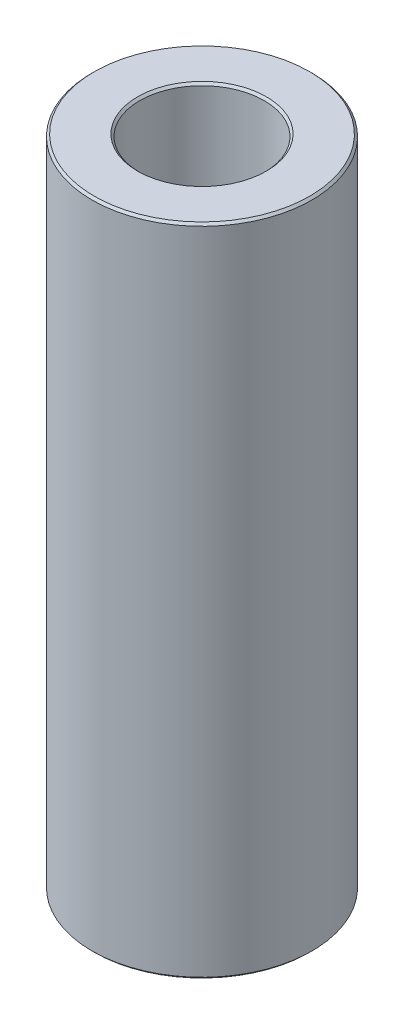
ISO-10303-21;
HEADER;
FILE_DESCRIPTION(('STEP AP214'),'2;1');
FILE_NAME('part.step','',(''),(''),'','','');
FILE_SCHEMA(('AUTOMOTIVE_DESIGN { 1 0 10303 214 1 1 1 1 }'));
ENDSEC;
DATA;
#1=APPLICATION_CONTEXT('core data for automotive mechanical design processes');
#2=APPLICATION_PROTOCOL_DEFINITION('international standard','automotive_design',2000,#1);
#3=PRODUCT_CONTEXT('',#1,'mechanical');
#4=PRODUCT('Part','Part','',(#3));
#5=PRODUCT_RELATED_PRODUCT_CATEGORY('part','',(#4));
#6=PRODUCT_DEFINITION_FORMATION('','',#4);
#7=PRODUCT_DEFINITION_CONTEXT('part definition',#1,'design');
#8=PRODUCT_DEFINITION('design','',#6,#7);
#9=PRODUCT_DEFINITION_SHAPE('','',#8);
#10=(LENGTH_UNIT() NAMED_UNIT(*) SI_UNIT(.MILLI.,.METRE.));
#11=(NAMED_UNIT(*) PLANE_ANGLE_UNIT() SI_UNIT($,.RADIAN.));
#12=(NAMED_UNIT(*) SI_UNIT($,.STERADIAN.) SOLID_ANGLE_UNIT());
#13=UNCERTAINTY_MEASURE_WITH_UNIT(LENGTH_MEASURE(1.E-05),#10,'distance_accuracy_value','');
#14=(GEOMETRIC_REPRESENTATION_CONTEXT(3) GLOBAL_UNCERTAINTY_ASSIGNED_CONTEXT((#13)) GLOBAL_UNIT_ASSIGNED_CONTEXT((#10,
#11,#12)) REPRESENTATION_CONTEXT('',''));
#15=CARTESIAN_POINT('',(0.,0.,0.));
#16=DIRECTION('',(0.,0.,1.));
#17=DIRECTION('',(1.,0.,0.));
#18=AXIS2_PLACEMENT_3D('',#15,#16,#17);
#19=CARTESIAN_POINT('',(0.,252.979951956953,0.));
#20=DIRECTION('',(0.,-1.,0.));
#21=DIRECTION('',(0.,0.,-1.));
#22=AXIS2_PLACEMENT_3D('',#19,#20,#21);
#23=CYLINDRICAL_SURFACE('',#22,42.5);
#24=CARTESIAN_POINT('',(0.,0.854161998392,0.));
#25=DIRECTION('',(0.,1.,0.));
#26=DIRECTION('',(0.,0.,1.));
#27=AXIS2_PLACEMENT_3D('',#24,#25,#26);
#28=CIRCLE('',#27,42.5);
#29=CARTESIAN_POINT('',(0.,0.854161998392,42.5));
#30=VERTEX_POINT('',#29);
#31=EDGE_CURVE('E10',#30,#30,#28,.T.);
#32=ORIENTED_EDGE('',*,*,#31,.T.);
#33=EDGE_LOOP('',(#32));
#34=FACE_BOUND('',#33,.T.);
#35=CARTESIAN_POINT('',(0.,252.125789958561,0.));
#36=DIRECTION('',(0.,1.,0.));
#37=DIRECTION('',(0.,0.,1.));
#38=AXIS2_PLACEMENT_3D('',#35,#36,#37);
#39=CIRCLE('',#38,42.5);
#40=CARTESIAN_POINT('',(0.,252.125789958561,-42.5));
#41=VERTEX_POINT('',#40);
#42=EDGE_CURVE('E50',#41,#41,#39,.F.);
#43=ORIENTED_EDGE('',*,*,#42,.T.);
#44=EDGE_LOOP('',(#43));
#45=FACE_BOUND('',#44,.T.);
#46=ADVANCED_FACE('F39',(#34,#45),#23,.T.);
#47=CARTESIAN_POINT('',(0.,252.979951956953,0.));
#48=DIRECTION('',(0.,1.,0.));
#49=DIRECTION('',(0.,0.,1.));
#50=AXIS2_PLACEMENT_3D('',#47,#48,#49);
#51=PLANE('',#50);
#52=CARTESIAN_POINT('',(0.,252.979951956953,0.));
#53=DIRECTION('',(0.,1.,0.));
#54=DIRECTION('',(0.,0.,1.));
#55=AXIS2_PLACEMENT_3D('',#52,#53,#54);
#56=CIRCLE('',#55,24.8964113158572);
#57=CARTESIAN_POINT('',(0.,252.979951956953,24.8964113158572));
#58=VERTEX_POINT('',#57);
#59=EDGE_CURVE('E58',#58,#58,#56,.F.);
#60=ORIENTED_EDGE('',*,*,#59,.T.);
#61=EDGE_LOOP('',(#60));
#62=FACE_BOUND('',#61,.T.);
#63=CARTESIAN_POINT('',(0.,252.979951956953,0.));
#64=DIRECTION('',(0.,1.,0.));
#65=DIRECTION('',(0.,0.,1.));
#66=AXIS2_PLACEMENT_3D('',#63,#64,#65);
#67=CIRCLE('',#66,41.6458380016081);
#68=CARTESIAN_POINT('',(0.,252.979951956953,-41.6458380016081));
#69=VERTEX_POINT('',#68);
#70=EDGE_CURVE('E61',#69,#69,#67,.T.);
#71=ORIENTED_EDGE('',*,*,#70,.T.);
#72=EDGE_LOOP('',(#71));
#73=FACE_BOUND('',#72,.T.);
#74=ADVANCED_FACE('F88',(#62,#73),#51,.T.);
#75=CARTESIAN_POINT('',(0.,0.,0.));
#76=DIRECTION('',(0.,1.,0.));
#77=DIRECTION('',(0.,0.,1.));
#78=AXIS2_PLACEMENT_3D('',#75,#76,#77);
#79=PLANE('',#78);
#80=CARTESIAN_POINT('',(0.,0.,0.));
#81=DIRECTION('',(0.,1.,0.));
#82=DIRECTION('',(0.,0.,1.));
#83=AXIS2_PLACEMENT_3D('',#80,#81,#82);
#84=CIRCLE('',#83,24.8964113158572);
#85=CARTESIAN_POINT('',(0.,0.,-24.8964113158572));
#86=VERTEX_POINT('',#85);
#87=EDGE_CURVE('E51',#86,#86,#84,.T.);
#88=ORIENTED_EDGE('',*,*,#87,.T.);
#89=EDGE_LOOP('',(#88));
#90=FACE_BOUND('',#89,.T.);
#91=CARTESIAN_POINT('',(0.,0.,0.));
#92=DIRECTION('',(0.,1.,0.));
#93=DIRECTION('',(0.,0.,1.));
#94=AXIS2_PLACEMENT_3D('',#91,#92,#93);
#95=CIRCLE('',#94,41.645838001608);
#96=CARTESIAN_POINT('',(0.,0.,41.645838001608));
#97=VERTEX_POINT('',#96);
#98=EDGE_CURVE('E54',#97,#97,#95,.F.);
#99=ORIENTED_EDGE('',*,*,#98,.T.);
#100=EDGE_LOOP('',(#99));
#101=FACE_BOUND('',#100,.T.);
#102=ADVANCED_FACE('F83',(#90,#101),#79,.F.);
#103=CARTESIAN_POINT('',(0.,252.979951956953,0.));
#104=DIRECTION('',(0.,-1.,0.));
#105=DIRECTION('',(0.,0.,-1.));
#106=AXIS2_PLACEMENT_3D('',#103,#104,#105);
#107=CYLINDRICAL_SURFACE('',#106,24.0422493174653);
#108=CARTESIAN_POINT('',(0.,252.125789958561,0.));
#109=DIRECTION('',(0.,1.,0.));
#110=DIRECTION('',(0.,0.,1.));
#111=AXIS2_PLACEMENT_3D('',#108,#109,#110);
#112=CIRCLE('',#111,24.0422493174653);
#113=CARTESIAN_POINT('',(0.,252.125789958561,-24.0422493174653));
#114=VERTEX_POINT('',#113);
#115=EDGE_CURVE('E67',#114,#114,#112,.T.);
#116=CARTESIAN_POINT('',(0.,0.854161998391945,0.));
#117=DIRECTION('',(0.,1.,0.));
#118=DIRECTION('',(0.,0.,1.));
#119=AXIS2_PLACEMENT_3D('',#116,#117,#118);
#120=CIRCLE('',#119,24.0422493174653);
#121=CARTESIAN_POINT('',(0.,0.854161998391945,-24.0422493174653));
#122=VERTEX_POINT('',#121);
#123=EDGE_CURVE('E69',#122,#122,#120,.F.);
#124=CARTESIAN_POINT('',(0.,252.125789958561,-24.0422493174653));
#125=CARTESIAN_POINT('',(0.,249.508377167309,-24.0422493174653));
#126=CARTESIAN_POINT('',(0.,246.890964376057,-24.0422493174653));
#127=CARTESIAN_POINT('',(0.,241.656138793554,-24.0422493174653));
#128=CARTESIAN_POINT('',(0.,239.038726002302,-24.0422493174653));
#129=CARTESIAN_POINT('',(0.,233.803900419799,-24.0422493174653));
#130=CARTESIAN_POINT('',(0.,231.186487628547,-24.0422493174653));
#131=CARTESIAN_POINT('',(0.,225.951662046043,-24.0422493174653));
#132=CARTESIAN_POINT('',(0.,223.334249254792,-24.0422493174653));
#133=CARTESIAN_POINT('',(0.,218.099423672288,-24.0422493174653));
#134=CARTESIAN_POINT('',(0.,215.482010881036,-24.0422493174653));
#135=CARTESIAN_POINT('',(0.,210.247185298533,-24.0422493174653));
#136=CARTESIAN_POINT('',(0.,207.629772507281,-24.0422493174653));
#137=CARTESIAN_POINT('',(0.,202.394946924778,-24.0422493174653));
#138=CARTESIAN_POINT('',(0.,199.777534133526,-24.0422493174653));
#139=CARTESIAN_POINT('',(0.,194.542708551022,-24.0422493174653));
#140=CARTESIAN_POINT('',(0.,191.925295759771,-24.0422493174653));
#141=CARTESIAN_POINT('',(0.,186.690470177267,-24.0422493174653));
#142=CARTESIAN_POINT('',(0.,184.073057386015,-24.0422493174653));
#143=CARTESIAN_POINT('',(0.,178.838231803512,-24.0422493174653));
#144=CARTESIAN_POINT('',(0.,176.22081901226,-24.0422493174653));
#145=CARTESIAN_POINT('',(0.,170.985993429756,-24.0422493174653));
#146=CARTESIAN_POINT('',(0.,168.368580638505,-24.0422493174653));
#147=CARTESIAN_POINT('',(0.,163.133755056001,-24.0422493174653));
#148=CARTESIAN_POINT('',(0.,160.516342264749,-24.0422493174653));
#149=CARTESIAN_POINT('',(0.,155.281516682246,-24.0422493174653));
#150=CARTESIAN_POINT('',(0.,152.664103890994,-24.0422493174653));
#151=CARTESIAN_POINT('',(0.,147.429278308491,-24.0422493174653));
#152=CARTESIAN_POINT('',(0.,144.811865517239,-24.0422493174653));
#153=CARTESIAN_POINT('',(0.,139.577039934735,-24.0422493174653));
#154=CARTESIAN_POINT('',(0.,136.959627143484,-24.0422493174653));
#155=CARTESIAN_POINT('',(0.,131.72480156098,-24.0422493174653));
#156=CARTESIAN_POINT('',(0.,129.107388769728,-24.0422493174653));
#157=CARTESIAN_POINT('',(0.,123.872563187225,-24.0422493174653));
#158=CARTESIAN_POINT('',(0.,121.255150395973,-24.0422493174653));
#159=CARTESIAN_POINT('',(0.,116.020324813469,-24.0422493174653));
#160=CARTESIAN_POINT('',(0.,113.402912022218,-24.0422493174653));
#161=CARTESIAN_POINT('',(0.,108.168086439714,-24.0422493174653));
#162=CARTESIAN_POINT('',(0.,105.550673648462,-24.0422493174653));
#163=CARTESIAN_POINT('',(0.,100.315848065959,-24.0422493174653));
#164=CARTESIAN_POINT('',(0.,97.6984352747071,-24.0422493174653));
#165=CARTESIAN_POINT('',(0.,92.4636096922036,-24.0422493174653));
#166=CARTESIAN_POINT('',(0.,89.8461969009518,-24.0422493174653));
#167=CARTESIAN_POINT('',(0.,84.6113713184483,-24.0422493174653));
#168=CARTESIAN_POINT('',(0.,81.9939585271965,-24.0422493174653));
#169=CARTESIAN_POINT('',(0.,76.759132944693,-24.0422493174653));
#170=CARTESIAN_POINT('',(0.,74.1417201534412,-24.0422493174653));
#171=CARTESIAN_POINT('',(0.,68.9068945709377,-24.0422493174653));
#172=CARTESIAN_POINT('',(0.,66.289481779686,-24.0422493174653));
#173=CARTESIAN_POINT('',(0.,61.0546561971824,-24.0422493174653));
#174=CARTESIAN_POINT('',(0.,58.4372434059307,-24.0422493174653));
#175=CARTESIAN_POINT('',(0.,53.2024178234271,-24.0422493174653));
#176=CARTESIAN_POINT('',(0.,50.5850050321754,-24.0422493174653));
#177=CARTESIAN_POINT('',(0.,45.3501794496719,-24.0422493174653));
#178=CARTESIAN_POINT('',(0.,42.7327666584201,-24.0422493174653));
#179=CARTESIAN_POINT('',(0.,37.4979410759166,-24.0422493174653));
#180=CARTESIAN_POINT('',(0.,34.8805282846648,-24.0422493174653));
#181=CARTESIAN_POINT('',(0.,29.6457027021613,-24.0422493174653));
#182=CARTESIAN_POINT('',(0.,27.0282899109095,-24.0422493174653));
#183=CARTESIAN_POINT('',(0.,21.793464328406,-24.0422493174653));
#184=CARTESIAN_POINT('',(0.,19.1760515371543,-24.0422493174653));
#185=CARTESIAN_POINT('',(0.,13.9412259546507,-24.0422493174653));
#186=CARTESIAN_POINT('',(0.,11.323813163399,-24.0422493174653));
#187=CARTESIAN_POINT('',(0.,6.08898758089545,-24.0422493174653));
#188=CARTESIAN_POINT('',(0.,3.4715747896437,-24.0422493174653));
#189=CARTESIAN_POINT('',(0.,0.854161998391945,-24.0422493174653));
#190=B_SPLINE_CURVE_WITH_KNOTS('',3,(#124,#125,#126,#127,#128,#129,#130,#131,#132,#133,#134,
#135,#136,#137,#138,#139,#140,#141,#142,#143,#144,#145,#146,#147,#148,#149,#150,#151,#152,#153,
#154,#155,#156,#157,#158,#159,#160,#161,#162,#163,#164,#165,#166,#167,#168,#169,#170,#171,#172,
#173,#174,#175,#176,#177,#178,#179,#180,#181,#182,#183,#184,#185,#186,#187,#188,#189),
.UNSPECIFIED.,.F.,.F.,(4,2,2,2,2,2,2,2,2,2,2,2,2,2,2,2,2,2,2,2,2,2,2,2,2,2,2,2,2,2,2,2,4),(0.,
7.85223837375532,15.7044767475106,23.5567151212659,31.4089534950212,39.2611918687765,
47.1134302425317,54.965668616287,62.8179069900423,70.6701453637976,78.5223837375529,
86.3746221113081,94.2268604850635,102.079098858819,109.931337232574,117.783575606329,
125.635813980085,133.48805235384,141.340290727595,149.19252910135,157.044767475106,
164.897005848861,172.749244222616,180.601482596372,188.453720970127,196.305959343882,
204.158197717637,212.010436091393,219.862674465148,227.714912838903,235.567151212659,
243.419389586414,251.271627960169),.UNSPECIFIED.);
#191=EDGE_CURVE('BSEAM71',#114,#122,#190,.T.);
#192=ORIENTED_EDGE('',*,*,#115,.T.);
#193=ORIENTED_EDGE('',*,*,#123,.T.);
#194=ORIENTED_EDGE('',*,*,#191,.T.);
#195=ORIENTED_EDGE('',*,*,#191,.F.);
#196=EDGE_LOOP('',(#192,#194,#193,#195));
#197=FACE_BOUND('',#196,.T.);
#198=ADVANCED_FACE('F71',(#197),#107,.F.);
#199=CARTESIAN_POINT('',(0.,252.125789958561,0.));
#200=DIRECTION('',(0.,1.,0.));
#201=DIRECTION('',(0.,0.,1.));
#202=AXIS2_PLACEMENT_3D('',#199,#200,#201);
#203=CONICAL_SURFACE('',#202,24.0422493174653,0.785398163397438);
#204=ORIENTED_EDGE('',*,*,#59,.F.);
#205=EDGE_LOOP('',(#204));
#206=FACE_BOUND('',#205,.T.);
#207=ORIENTED_EDGE('',*,*,#115,.F.);
#208=EDGE_LOOP('',(#207));
#209=FACE_BOUND('',#208,.T.);
#210=ADVANCED_FACE('F77',(#206,#209),#203,.F.);
#211=CARTESIAN_POINT('',(0.,0.,0.));
#212=DIRECTION('',(0.,-1.,0.));
#213=DIRECTION('',(0.,0.,-1.));
#214=AXIS2_PLACEMENT_3D('',#211,#212,#213);
#215=CONICAL_SURFACE('',#214,24.8964113158572,0.785398163397438);
#216=CARTESIAN_POINT('',(0.,0.854161998391945,-24.0422493174653));
#217=CARTESIAN_POINT('',(0.,0.845264477575362,-24.0511468382819));
#218=CARTESIAN_POINT('',(0.,0.836366956758779,-24.0600443590984));
#219=CARTESIAN_POINT('',(0.,0.818571915125613,-24.0778394007316));
#220=CARTESIAN_POINT('',(0.,0.809674394309031,-24.0867369215482));
#221=CARTESIAN_POINT('',(0.,0.791879352675865,-24.1045319631814));
#222=CARTESIAN_POINT('',(0.,0.782981831859283,-24.1134294839979));
#223=CARTESIAN_POINT('',(0.,0.765186790226117,-24.1312245256311));
#224=CARTESIAN_POINT('',(0.,0.756289269409534,-24.1401220464477));
#225=CARTESIAN_POINT('',(0.,0.738494227776368,-24.1579170880809));
#226=CARTESIAN_POINT('',(0.,0.729596706959786,-24.1668146088974));
#227=CARTESIAN_POINT('',(0.,0.71180166532662,-24.1846096505306));
#228=CARTESIAN_POINT('',(0.,0.702904144510038,-24.1935071713472));
#229=CARTESIAN_POINT('',(0.,0.685109102876872,-24.2113022129803));
#230=CARTESIAN_POINT('',(0.,0.676211582060289,-24.2201997337969));
#231=CARTESIAN_POINT('',(0.,0.658416540427124,-24.2379947754301));
#232=CARTESIAN_POINT('',(0.,0.649519019610541,-24.2468922962467));
#233=CARTESIAN_POINT('',(0.,0.631723977977376,-24.2646873378798));
#234=CARTESIAN_POINT('',(0.,0.622826457160793,-24.2735848586964));
#235=CARTESIAN_POINT('',(0.,0.605031415527628,-24.2913799003296));
#236=CARTESIAN_POINT('',(0.,0.596133894711044,-24.3002774211462));
#237=CARTESIAN_POINT('',(0.,0.578338853077879,-24.3180724627793));
#238=CARTESIAN_POINT('',(0.,0.569441332261296,-24.3269699835959));
#239=CARTESIAN_POINT('',(0.,0.551646290628131,-24.3447650252291));
#240=CARTESIAN_POINT('',(0.,0.542748769811548,-24.3536625460457));
#241=CARTESIAN_POINT('',(0.,0.524953728178382,-24.3714575876788));
#242=CARTESIAN_POINT('',(0.,0.5160562073618,-24.3803551084954));
#243=CARTESIAN_POINT('',(0.,0.498261165728634,-24.3981501501286));
#244=CARTESIAN_POINT('',(0.,0.489363644912051,-24.4070476709452));
#245=CARTESIAN_POINT('',(0.,0.471568603278886,-24.4248427125783));
#246=CARTESIAN_POINT('',(0.,0.462671082462304,-24.4337402333949));
#247=CARTESIAN_POINT('',(0.,0.444876040829138,-24.4515352750281));
#248=CARTESIAN_POINT('',(0.,0.435978520012555,-24.4604327958447));
#249=CARTESIAN_POINT('',(0.,0.418183478379389,-24.4782278374778));
#250=CARTESIAN_POINT('',(0.,0.409285957562807,-24.4871253582944));
#251=CARTESIAN_POINT('',(0.,0.391490915929641,-24.5049203999276));
#252=CARTESIAN_POINT('',(0.,0.382593395113059,-24.5138179207442));
#253=CARTESIAN_POINT('',(0.,0.364798353479893,-24.5316129623773));
#254=CARTESIAN_POINT('',(0.,0.35590083266331,-24.5405104831939));
#255=CARTESIAN_POINT('',(0.,0.338105791030145,-24.5583055248271));
#256=CARTESIAN_POINT('',(0.,0.329208270213562,-24.5672030456437));
#257=CARTESIAN_POINT('',(0.,0.311413228580396,-24.5849980872768));
#258=CARTESIAN_POINT('',(0.,0.302515707763814,-24.5938956080934));
#259=CARTESIAN_POINT('',(0.,0.284720666130648,-24.6116906497266));
#260=CARTESIAN_POINT('',(0.,0.275823145314066,-24.6205881705431));
#261=CARTESIAN_POINT('',(0.,0.2580281036809,-24.6383832121763));
#262=CARTESIAN_POINT('',(0.,0.249130582864317,-24.6472807329929));
#263=CARTESIAN_POINT('',(0.,0.231335541231151,-24.6650757746261));
#264=CARTESIAN_POINT('',(0.,0.222438020414569,-24.6739732954426));
#265=CARTESIAN_POINT('',(0.,0.204642978781403,-24.6917683370758));
#266=CARTESIAN_POINT('',(0.,0.195745457964821,-24.7006658578924));
#267=CARTESIAN_POINT('',(0.,0.177950416331655,-24.7184608995256));
#268=CARTESIAN_POINT('',(0.,0.169052895515072,-24.7273584203421));
#269=CARTESIAN_POINT('',(0.,0.151257853881907,-24.7451534619753));
#270=CARTESIAN_POINT('',(0.,0.142360333065324,-24.7540509827919));
#271=CARTESIAN_POINT('',(0.,0.124565291432159,-24.771846024425));
#272=CARTESIAN_POINT('',(0.,0.115667770615576,-24.7807435452416));
#273=CARTESIAN_POINT('',(0.,0.0978727289824105,-24.7985385868748));
#274=CARTESIAN_POINT('',(0.,0.0889752081658273,-24.8074361076914));
#275=CARTESIAN_POINT('',(0.,0.0711801665326617,-24.8252311493245));
#276=CARTESIAN_POINT('',(0.,0.0622826457160792,-24.8341286701411));
#277=CARTESIAN_POINT('',(0.,0.0444876040829139,-24.8519237117743));
#278=CARTESIAN_POINT('',(0.,0.0355900832663311,-24.8608212325909));
#279=CARTESIAN_POINT('',(0.,0.0177950416331655,-24.878616274224));
#280=CARTESIAN_POINT('',(0.,0.00889752081658265,-24.8875137950406));
#281=CARTESIAN_POINT('',(0.,0.,-24.8964113158572));
#282=B_SPLINE_CURVE_WITH_KNOTS('',3,(#216,#217,#218,#219,#220,#221,#222,#223,#224,#225,#226,
#227,#228,#229,#230,#231,#232,#233,#234,#235,#236,#237,#238,#239,#240,#241,#242,#243,#244,#245,
#246,#247,#248,#249,#250,#251,#252,#253,#254,#255,#256,#257,#258,#259,#260,#261,#262,#263,#264,
#265,#266,#267,#268,#269,#270,#271,#272,#273,#274,#275,#276,#277,#278,#279,#280,#281),
.UNSPECIFIED.,.F.,.F.,(4,2,2,2,2,2,2,2,2,2,2,2,2,2,2,2,2,2,2,2,2,2,2,2,2,2,2,2,2,2,2,2,4),(0.,
0.0377489838309248,0.0754979676618496,0.113246951492774,0.150995935323697,0.188744919154622,
0.226493902985546,0.264242886816471,0.301991870647396,0.339740854478321,0.377489838309243,
0.415238822140168,0.452987805971093,0.490736789802018,0.528485773632942,0.566234757463867,
0.603983741294789,0.641732725125714,0.679481708956639,0.717230692787564,0.754979676618489,
0.792728660449414,0.830477644280338,0.868226628111261,0.905975611942186,0.94372459577311,
0.981473579604035,1.01922256343496,1.05697154726588,1.09472053109681,1.13246951492773,
1.17021849875866,1.20796748258958),.UNSPECIFIED.);
#283=EDGE_CURVE('BSEAM73',#122,#86,#282,.T.);
#284=ORIENTED_EDGE('',*,*,#123,.F.);
#285=ORIENTED_EDGE('',*,*,#87,.F.);
#286=ORIENTED_EDGE('',*,*,#283,.T.);
#287=ORIENTED_EDGE('',*,*,#283,.F.);
#288=EDGE_LOOP('',(#284,#286,#285,#287));
#289=FACE_BOUND('',#288,.T.);
#290=ADVANCED_FACE('F73',(#289),#215,.F.);
#291=CARTESIAN_POINT('',(0.,0.854161998392,0.));
#292=DIRECTION('',(0.,1.,0.));
#293=DIRECTION('',(0.,0.,1.));
#294=AXIS2_PLACEMENT_3D('',#291,#292,#293);
#295=CONICAL_SURFACE('',#294,42.5,0.785398163397432);
#296=ORIENTED_EDGE('',*,*,#98,.F.);
#297=EDGE_LOOP('',(#296));
#298=FACE_BOUND('',#297,.T.);
#299=ORIENTED_EDGE('',*,*,#31,.F.);
#300=EDGE_LOOP('',(#299));
#301=FACE_BOUND('',#300,.T.);
#302=ADVANCED_FACE('F76',(#298,#301),#295,.T.);
#303=CARTESIAN_POINT('',(0.,252.979951956953,0.));
#304=DIRECTION('',(0.,-1.,0.));
#305=DIRECTION('',(0.,0.,-1.));
#306=AXIS2_PLACEMENT_3D('',#303,#304,#305);
#307=CONICAL_SURFACE('',#306,41.6458380016081,0.785398163397432);
#308=CARTESIAN_POINT('',(0.,252.125789958561,-42.5));
#309=CARTESIAN_POINT('',(0.,252.134687479378,-42.4911024791835));
#310=CARTESIAN_POINT('',(0.,252.143585000194,-42.4822049583669));
#311=CARTESIAN_POINT('',(0.,252.161380041827,-42.4644099167337));
#312=CARTESIAN_POINT('',(0.,252.170277562644,-42.4555123959171));
#313=CARTESIAN_POINT('',(0.,252.188072604277,-42.437717354284));
#314=CARTESIAN_POINT('',(0.,252.196970125094,-42.4288198334674));
#315=CARTESIAN_POINT('',(0.,252.214765166727,-42.4110247918342));
#316=CARTESIAN_POINT('',(0.,252.223662687543,-42.4021272710176));
#317=CARTESIAN_POINT('',(0.,252.241457729177,-42.3843322293845));
#318=CARTESIAN_POINT('',(0.,252.250355249993,-42.3754347085679));
#319=CARTESIAN_POINT('',(0.,252.268150291626,-42.3576396669347));
#320=CARTESIAN_POINT('',(0.,252.277047812443,-42.3487421461181));
#321=CARTESIAN_POINT('',(0.,252.294842854076,-42.330947104485));
#322=CARTESIAN_POINT('',(0.,252.303740374893,-42.3220495836684));
#323=CARTESIAN_POINT('',(0.,252.321535416526,-42.3042545420352));
#324=CARTESIAN_POINT('',(0.,252.330432937342,-42.2953570212186));
#325=CARTESIAN_POINT('',(0.,252.348227978976,-42.2775619795855));
#326=CARTESIAN_POINT('',(0.,252.357125499792,-42.2686644587689));
#327=CARTESIAN_POINT('',(0.,252.374920541425,-42.2508694171357));
#328=CARTESIAN_POINT('',(0.,252.383818062242,-42.2419718963191));
#329=CARTESIAN_POINT('',(0.,252.401613103875,-42.224176854686));
#330=CARTESIAN_POINT('',(0.,252.410510624692,-42.2152793338694));
#331=CARTESIAN_POINT('',(0.,252.428305666325,-42.1974842922362));
#332=CARTESIAN_POINT('',(0.,252.437203187141,-42.1885867714197));
#333=CARTESIAN_POINT('',(0.,252.454998228775,-42.1707917297865));
#334=CARTESIAN_POINT('',(0.,252.463895749591,-42.1618942089699));
#335=CARTESIAN_POINT('',(0.,252.481690791224,-42.1440991673367));
#336=CARTESIAN_POINT('',(0.,252.490588312041,-42.1352016465202));
#337=CARTESIAN_POINT('',(0.,252.508383353674,-42.117406604887));
#338=CARTESIAN_POINT('',(0.,252.517280874491,-42.1085090840704));
#339=CARTESIAN_POINT('',(0.,252.535075916124,-42.0907140424372));
#340=CARTESIAN_POINT('',(0.,252.54397343694,-42.0818165216207));
#341=CARTESIAN_POINT('',(0.,252.561768478574,-42.0640214799875));
#342=CARTESIAN_POINT('',(0.,252.57066599939,-42.0551239591709));
#343=CARTESIAN_POINT('',(0.,252.588461041023,-42.0373289175377));
#344=CARTESIAN_POINT('',(0.,252.59735856184,-42.0284313967212));
#345=CARTESIAN_POINT('',(0.,252.615153603473,-42.010636355088));
#346=CARTESIAN_POINT('',(0.,252.62405112429,-42.0017388342714));
#347=CARTESIAN_POINT('',(0.,252.641846165923,-41.9839437926383));
#348=CARTESIAN_POINT('',(0.,252.650743686739,-41.9750462718217));
#349=CARTESIAN_POINT('',(0.,252.668538728373,-41.9572512301885));
#350=CARTESIAN_POINT('',(0.,252.677436249189,-41.9483537093719));
#351=CARTESIAN_POINT('',(0.,252.695231290822,-41.9305586677388));
#352=CARTESIAN_POINT('',(0.,252.704128811639,-41.9216611469222));
#353=CARTESIAN_POINT('',(0.,252.721923853272,-41.903866105289));
#354=CARTESIAN_POINT('',(0.,252.730821374089,-41.8949685844724));
#355=CARTESIAN_POINT('',(0.,252.748616415722,-41.8771735428393));
#356=CARTESIAN_POINT('',(0.,252.757513936538,-41.8682760220227));
#357=CARTESIAN_POINT('',(0.,252.775308978172,-41.8504809803895));
#358=CARTESIAN_POINT('',(0.,252.784206498988,-41.8415834595729));
#359=CARTESIAN_POINT('',(0.,252.802001540621,-41.8237884179398));
#360=CARTESIAN_POINT('',(0.,252.810899061438,-41.8148908971232));
#361=CARTESIAN_POINT('',(0.,252.828694103071,-41.79709585549));
#362=CARTESIAN_POINT('',(0.,252.837591623888,-41.7881983346734));
#363=CARTESIAN_POINT('',(0.,252.855386665521,-41.7704032930403));
#364=CARTESIAN_POINT('',(0.,252.864284186337,-41.7615057722237));
#365=CARTESIAN_POINT('',(0.,252.882079227971,-41.7437107305905));
#366=CARTESIAN_POINT('',(0.,252.890976748787,-41.734813209774));
#367=CARTESIAN_POINT('',(0.,252.90877179042,-41.7170181681408));
#368=CARTESIAN_POINT('',(0.,252.917669311237,-41.7081206473242));
#369=CARTESIAN_POINT('',(0.,252.93546435287,-41.690325605691));
#370=CARTESIAN_POINT('',(0.,252.944361873687,-41.6814280848745));
#371=CARTESIAN_POINT('',(0.,252.96215691532,-41.6636330432413));
#372=CARTESIAN_POINT('',(0.,252.971054436136,-41.6547355224247));
#373=CARTESIAN_POINT('',(0.,252.979951956953,-41.6458380016081));
#374=B_SPLINE_CURVE_WITH_KNOTS('',3,(#308,#309,#310,#311,#312,#313,#314,#315,#316,#317,#318,
#319,#320,#321,#322,#323,#324,#325,#326,#327,#328,#329,#330,#331,#332,#333,#334,#335,#336,#337,
#338,#339,#340,#341,#342,#343,#344,#345,#346,#347,#348,#349,#350,#351,#352,#353,#354,#355,#356,
#357,#358,#359,#360,#361,#362,#363,#364,#365,#366,#367,#368,#369,#370,#371,#372,#373),
.UNSPECIFIED.,.F.,.F.,(4,2,2,2,2,2,2,2,2,2,2,2,2,2,2,2,2,2,2,2,2,2,2,2,2,2,2,2,2,2,2,2,4),(0.,
0.0377489838309248,0.0754979676618496,0.113246951492774,0.150995935323694,0.188744919154619,
0.226493902985544,0.264242886816469,0.301991870647394,0.339740854478318,0.377489838309243,
0.415238822140168,0.452987805971127,0.490736789802013,0.528485773632938,0.566234757463862,
0.603983741294787,0.641732725125712,0.679481708956637,0.717230692787562,0.754979676618482,
0.792728660449406,0.830477644280331,0.868226628111256,0.90597561194222,0.943724595773145,
0.98147357960407,1.01922256343499,1.05697154726591,1.09472053109684,1.13246951492776,
1.17021849875869,1.20796748258961),.UNSPECIFIED.);
#375=EDGE_CURVE('BSEAM45',#41,#69,#374,.T.);
#376=ORIENTED_EDGE('',*,*,#42,.F.);
#377=ORIENTED_EDGE('',*,*,#70,.F.);
#378=ORIENTED_EDGE('',*,*,#375,.T.);
#379=ORIENTED_EDGE('',*,*,#375,.F.);
#380=EDGE_LOOP('',(#376,#378,#377,#379));
#381=FACE_BOUND('',#380,.T.);
#382=ADVANCED_FACE('F45',(#381),#307,.T.);
#383=CLOSED_SHELL('',(#46,#74,#102,#198,#210,#290,#302,#382));
#384=MANIFOLD_SOLID_BREP('B2',#383);
#385=ADVANCED_BREP_SHAPE_REPRESENTATION('',(#18,#384),#14);
#386=SHAPE_DEFINITION_REPRESENTATION(#9,#385);
ENDSEC;
END-ISO-10303-21;
